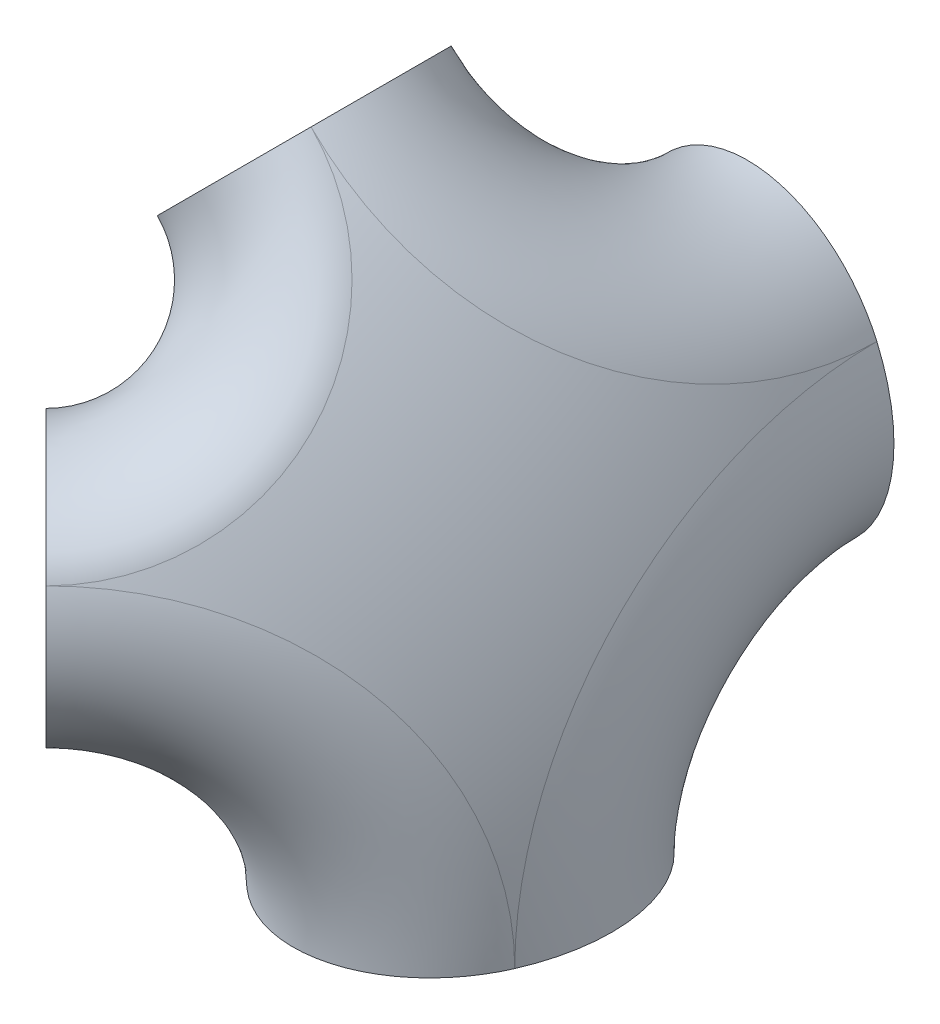
ISO-10303-21;
HEADER;
FILE_DESCRIPTION(('STEP AP214'),'2;1');
FILE_NAME('part.step','',(''),(''),'','','');
FILE_SCHEMA(('AUTOMOTIVE_DESIGN { 1 0 10303 214 1 1 1 1 }'));
ENDSEC;
DATA;
#1=APPLICATION_CONTEXT('core data for automotive mechanical design processes');
#2=APPLICATION_PROTOCOL_DEFINITION('international standard','automotive_design',2000,#1);
#3=PRODUCT_CONTEXT('',#1,'mechanical');
#4=PRODUCT('Part','Part','',(#3));
#5=PRODUCT_RELATED_PRODUCT_CATEGORY('part','',(#4));
#6=PRODUCT_DEFINITION_FORMATION('','',#4);
#7=PRODUCT_DEFINITION_CONTEXT('part definition',#1,'design');
#8=PRODUCT_DEFINITION('design','',#6,#7);
#9=PRODUCT_DEFINITION_SHAPE('','',#8);
#10=(LENGTH_UNIT() NAMED_UNIT(*) SI_UNIT(.MILLI.,.METRE.));
#11=(NAMED_UNIT(*) PLANE_ANGLE_UNIT() SI_UNIT($,.RADIAN.));
#12=(NAMED_UNIT(*) SI_UNIT($,.STERADIAN.) SOLID_ANGLE_UNIT());
#13=UNCERTAINTY_MEASURE_WITH_UNIT(LENGTH_MEASURE(1.E-05),#10,'distance_accuracy_value','');
#14=(GEOMETRIC_REPRESENTATION_CONTEXT(3) GLOBAL_UNCERTAINTY_ASSIGNED_CONTEXT((#13)) GLOBAL_UNIT_ASSIGNED_CONTEXT((#10,
#11,#12)) REPRESENTATION_CONTEXT('',''));
#15=CARTESIAN_POINT('',(0.,0.,0.));
#16=DIRECTION('',(0.,0.,1.));
#17=DIRECTION('',(1.,0.,0.));
#18=AXIS2_PLACEMENT_3D('',#15,#16,#17);
#19=CARTESIAN_POINT('',(0.,0.,0.));
#20=DIRECTION('',(0.,0.,1.));
#21=DIRECTION('',(1.,0.,0.));
#22=AXIS2_PLACEMENT_3D('',#19,#20,#21);
#23=PLANE('',#22);
#24=CARTESIAN_POINT('',(0.,0.,0.));
#25=DIRECTION('',(0.,0.,1.));
#26=DIRECTION('',(1.,0.,0.));
#27=AXIS2_PLACEMENT_3D('',#24,#25,#26);
#28=CIRCLE('',#27,3628.59960239999);
#29=CARTESIAN_POINT('',(3326.41437553861,1449.72496589782,0.));
#30=VERTEX_POINT('',#29);
#31=CARTESIAN_POINT('',(3326.4143964321,1449.72491795744,0.));
#32=VERTEX_POINT('',#31);
#33=EDGE_CURVE('E249',#30,#32,#28,.F.);
#34=ORIENTED_EDGE('',*,*,#33,.T.);
#35=CARTESIAN_POINT('',(2861.84298682111,1247.25442919149,0.));
#36=DIRECTION('',(0.,0.,-1.));
#37=DIRECTION('',(-0.399527387094056,0.916721259141401,0.));
#38=AXIS2_PLACEMENT_3D('',#35,#36,#37);
#39=ELLIPSE('',#38,654.070680233224,506.774992920008);
#40=CARTESIAN_POINT('',(2397.271573649,1044.78394859654,0.));
#41=VERTEX_POINT('',#40);
#42=EDGE_CURVE('E130',#32,#41,#39,.T.);
#43=ORIENTED_EDGE('',*,*,#42,.T.);
#44=CARTESIAN_POINT('',(2861.8429753245,1247.25445557059,0.));
#45=DIRECTION('',(0.,0.,-1.));
#46=DIRECTION('',(-0.399527310221823,0.916721292644016,0.));
#47=AXIS2_PLACEMENT_3D('',#44,#45,#46);
#48=ELLIPSE('',#47,583.48095860365,506.774992920001);
#49=EDGE_CURVE('E247',#30,#41,#48,.F.);
#50=ORIENTED_EDGE('',*,*,#49,.F.);
#51=EDGE_LOOP('',(#34,#43,#50));
#52=FACE_BOUND('',#51,.T.);
#53=ADVANCED_FACE('F59',(#52),#23,.F.);
#54=CARTESIAN_POINT('',(0.,0.,0.));
#55=DIRECTION('',(0.,1.,0.));
#56=DIRECTION('',(0.,0.,1.));
#57=AXIS2_PLACEMENT_3D('',#54,#55,#56);
#58=PLANE('',#57);
#59=CARTESIAN_POINT('',(2861.84298682111,-2.29116921664757E-13,1247.25442919149));
#60=DIRECTION('',(0.,1.,0.));
#61=DIRECTION('',(-0.399527387094056,0.,0.916721259141401));
#62=AXIS2_PLACEMENT_3D('',#59,#60,#61);
#63=ELLIPSE('',#62,654.070680233224,506.774992920008);
#64=CARTESIAN_POINT('',(2397.27157602307,0.,1044.78394314921));
#65=VERTEX_POINT('',#64);
#66=CARTESIAN_POINT('',(3326.4143964321,-2.6631014706311E-13,1449.72491795744));
#67=VERTEX_POINT('',#66);
#68=EDGE_CURVE('E237',#65,#67,#63,.F.);
#69=ORIENTED_EDGE('',*,*,#68,.T.);
#70=CARTESIAN_POINT('',(0.,0.,0.));
#71=DIRECTION('',(0.,1.,0.));
#72=DIRECTION('',(0.,0.,1.));
#73=AXIS2_PLACEMENT_3D('',#70,#71,#72);
#74=CIRCLE('',#73,3628.59960239999);
#75=CARTESIAN_POINT('',(3326.41437553861,3.66861085058443E-13,1449.72496589782));
#76=VERTEX_POINT('',#75);
#77=EDGE_CURVE('E129',#67,#76,#74,.F.);
#78=ORIENTED_EDGE('',*,*,#77,.T.);
#79=CARTESIAN_POINT('',(2861.8429753245,2.76946122828156E-13,1247.25445557059));
#80=DIRECTION('',(0.,1.,0.));
#81=DIRECTION('',(-0.399527310221823,0.,0.916721292644016));
#82=AXIS2_PLACEMENT_3D('',#79,#80,#81);
#83=ELLIPSE('',#82,583.48095860365,506.774992920001);
#84=EDGE_CURVE('E139',#65,#76,#83,.T.);
#85=ORIENTED_EDGE('',*,*,#84,.F.);
#86=EDGE_LOOP('',(#69,#78,#85));
#87=FACE_BOUND('',#86,.T.);
#88=ADVANCED_FACE('F172',(#87),#58,.F.);
#89=CARTESIAN_POINT('',(0.,0.,0.));
#90=DIRECTION('',(-0.707106781186547,0.,0.707106781186548));
#91=DIRECTION('',(0.707106781186548,0.,0.707106781186547));
#92=AXIS2_PLACEMENT_3D('',#89,#90,#91);
#93=PLANE('',#92);
#94=CARTESIAN_POINT('',(2054.5487169645,1141.68648568427,2054.54871696449));
#95=DIRECTION('',(-0.707106781186547,0.,0.707106781186548));
#96=DIRECTION('',(0.658124325987268,0.365711283784913,0.658124325987268));
#97=AXIS2_PLACEMENT_3D('',#94,#95,#96);
#98=ELLIPSE('',#97,506.774992920008,373.126714904901);
#99=CARTESIAN_POINT('',(1721.02776299877,956.353164393502,1721.02776299877));
#100=VERTEX_POINT('',#99);
#101=CARTESIAN_POINT('',(2388.06966994045,1327.01981053727,2388.06966994045));
#102=VERTEX_POINT('',#101);
#103=EDGE_CURVE('E136',#100,#102,#98,.F.);
#104=ORIENTED_EDGE('',*,*,#103,.F.);
#105=CARTESIAN_POINT('',(1721.02776189109,956.35316838019,1721.02776189109));
#106=CARTESIAN_POINT('',(1723.40242132185,947.806411229241,1723.40242132185));
#107=CARTESIAN_POINT('',(1725.90100458826,939.328491729458,1725.90100458826));
#108=CARTESIAN_POINT('',(1731.14260314192,922.522801198051,1731.14260314192));
#109=CARTESIAN_POINT('',(1733.88567503249,914.195065475923,1733.88567503249));
#110=CARTESIAN_POINT('',(1739.61209046449,897.705156078559,1739.61209046449));
#111=CARTESIAN_POINT('',(1742.59546429369,889.543003436305,1742.59546429369));
#112=CARTESIAN_POINT('',(1748.79820470788,873.399620298544,1748.79820470788));
#113=CARTESIAN_POINT('',(1752.01758035451,865.418396765491,1752.01758035451));
#114=CARTESIAN_POINT('',(1758.70311533481,849.616324910061,1758.70311533481));
#115=CARTESIAN_POINT('',(1762.17032450319,841.796364698737,1762.17032450319));
#116=CARTESIAN_POINT('',(1769.33396954872,826.369897250062,1769.33396954872));
#117=CARTESIAN_POINT('',(1773.0303923717,818.763377892606,1773.0303923717));
#118=CARTESIAN_POINT('',(1780.64787842575,803.779247005654,1780.64787842575));
#119=CARTESIAN_POINT('',(1784.56893178507,796.401625438801,1784.56893178507));
#120=CARTESIAN_POINT('',(1792.63125135689,781.8904613254,1792.63125135689));
#121=CARTESIAN_POINT('',(1796.77252224257,774.756923963783,1796.77252224257));
#122=CARTESIAN_POINT('',(1803.85955021032,763.075372399963,1803.85955021032));
#123=CARTESIAN_POINT('',(1806.74592022078,758.45501656065,1806.74592022078));
#124=CARTESIAN_POINT('',(1812.61307175791,749.33548241629,1812.61307175791));
#125=CARTESIAN_POINT('',(1815.59385499905,744.836306314506,1815.59385499905));
#126=CARTESIAN_POINT('',(1821.64811418511,735.964255697905,1821.64811418511));
#127=CARTESIAN_POINT('',(1824.72159247015,731.591384377135,1824.72159247015));
#128=CARTESIAN_POINT('',(1830.95938556457,722.977202352518,1830.95938556457));
#129=CARTESIAN_POINT('',(1834.12369993615,718.735891014782,1834.12369993615));
#130=CARTESIAN_POINT('',(1840.54157455168,710.389677874619,1840.54157455168));
#131=CARTESIAN_POINT('',(1843.79514276081,706.284788319481,1843.79514276081));
#132=CARTESIAN_POINT('',(1850.38908403108,698.217349012277,1850.38908403108));
#133=CARTESIAN_POINT('',(1853.72945271785,694.25479211112,1853.72945271785));
#134=CARTESIAN_POINT('',(1860.49047524791,686.48244433496,1860.49047524791));
#135=CARTESIAN_POINT('',(1863.91101526505,682.672455476745,1863.91101526505));
#136=CARTESIAN_POINT('',(1870.83423971231,675.205313952019,1870.83423971231));
#137=CARTESIAN_POINT('',(1874.33691964316,671.548152944665,1874.33691964316));
#138=CARTESIAN_POINT('',(1881.42228078939,664.391911506863,1881.42228078939));
#139=CARTESIAN_POINT('',(1885.00496418205,660.892835386532,1885.00496418205));
#140=CARTESIAN_POINT('',(1892.24744033134,654.058701050197,1892.24744033133));
#141=CARTESIAN_POINT('',(1895.90722875749,650.723633657829,1895.90722875749));
#142=CARTESIAN_POINT('',(1903.30120303079,644.223123186571,1903.30120303079));
#143=CARTESIAN_POINT('',(1907.03538576942,641.057673040651,1907.03538576941));
#144=CARTESIAN_POINT('',(1914.57509526717,634.902165285629,1914.57509526716));
#145=CARTESIAN_POINT('',(1918.38061928236,631.912100949018,1918.38061928235));
#146=CARTESIAN_POINT('',(1927.49827678615,625.026886027714,1927.49827678615));
#147=CARTESIAN_POINT('',(1932.84091548495,621.212132295888,1932.84091548495));
#148=CARTESIAN_POINT('',(1943.64620767444,613.939759254637,1943.64620767444));
#149=CARTESIAN_POINT('',(1949.10885896099,610.482133392848,1949.10885896099));
#150=CARTESIAN_POINT('',(1960.14435542735,603.938882129941,1960.14435542735));
#151=CARTESIAN_POINT('',(1965.71719677127,600.853243805758,1965.71719677127));
#152=CARTESIAN_POINT('',(1976.96288526548,595.068336489898,1976.96288526548));
#153=CARTESIAN_POINT('',(1982.63574082436,592.369100160164,1982.63574082436));
#154=CARTESIAN_POINT('',(1994.0647336899,587.373579550089,1994.0647336899));
#155=CARTESIAN_POINT('',(1999.82080263097,585.076982806444,1999.82080263097));
#156=CARTESIAN_POINT('',(2011.40801522387,580.897773304346,2011.40801522387));
#157=CARTESIAN_POINT('',(2017.23916262743,579.01518131972,2017.23916262743));
#158=CARTESIAN_POINT('',(2028.96161673126,575.67722998969,2028.96161673126));
#159=CARTESIAN_POINT('',(2034.85291602833,574.221818709515,2034.85291602833));
#160=CARTESIAN_POINT('',(2046.68068979548,571.74993425961,2046.68068979548));
#161=CARTESIAN_POINT('',(2052.61715749928,570.73339661405,2052.61715749928));
#162=CARTESIAN_POINT('',(2063.66636458135,569.263040801357,2063.66636458135));
#163=CARTESIAN_POINT('',(2068.77516186301,568.749435432711,2068.77516186301));
#164=CARTESIAN_POINT('',(2079.00383306236,568.057449562286,2079.00383306236));
#165=CARTESIAN_POINT('',(2084.12370613584,567.879044353733,2084.12370613584));
#166=CARTESIAN_POINT('',(2094.36343241177,567.862110327951,2094.36343241177));
#167=CARTESIAN_POINT('',(2099.48328559437,568.023559675083,2099.48328559436));
#168=CARTESIAN_POINT('',(2109.71198093705,568.689902512805,2109.71198093705));
#169=CARTESIAN_POINT('',(2114.8208228189,569.194804582198,2114.8208228189));
#170=CARTESIAN_POINT('',(2125.01139435597,570.54991181433,2125.01139435597));
#171=CARTESIAN_POINT('',(2130.0931427021,571.39983544346,2130.0931427021));
#172=CARTESIAN_POINT('',(2140.22196142037,573.446128205087,2140.22196142037));
#173=CARTESIAN_POINT('',(2145.26902989695,574.642516123075,2145.26902989695));
#174=CARTESIAN_POINT('',(2155.31572856778,577.381354588986,2155.31572856778));
#175=CARTESIAN_POINT('',(2160.3153612946,578.923786552068,2160.3153612946));
#176=CARTESIAN_POINT('',(2170.25471467571,582.352868809687,2170.25471467571));
#177=CARTESIAN_POINT('',(2175.1944422188,584.23947911726,2175.1944422188));
#178=CARTESIAN_POINT('',(2184.43759507709,588.116895676386,2184.43759507709));
#179=CARTESIAN_POINT('',(2188.74880326812,590.070700145188,2188.74880326812));
#180=CARTESIAN_POINT('',(2197.30661703364,594.242072873587,2197.30661703364));
#181=CARTESIAN_POINT('',(2201.55322754862,596.45962084628,2201.55322754862));
#182=CARTESIAN_POINT('',(2209.97380424327,601.154426508643,2209.97380424327));
#183=CARTESIAN_POINT('',(2214.14777388632,603.631671776671,2214.14777388632));
#184=CARTESIAN_POINT('',(2222.41532674772,608.84101067532,2222.41532674772));
#185=CARTESIAN_POINT('',(2226.50891153198,611.573099335585,2226.50891153198));
#186=CARTESIAN_POINT('',(2234.60737015651,617.285865777678,2234.60737015651));
#187=CARTESIAN_POINT('',(2238.61226171054,620.2664933443,2238.61226171054));
#188=CARTESIAN_POINT('',(2246.52707230052,626.470424835176,2246.52707230051));
#189=CARTESIAN_POINT('',(2250.43698874027,629.693735383415,2250.43698874026));
#190=CARTESIAN_POINT('',(2258.15491125037,636.375776565551,2258.15491125037));
#191=CARTESIAN_POINT('',(2261.96291629273,639.834509572957,2261.96291629273));
#192=CARTESIAN_POINT('',(2269.4705447286,646.979539164324,2269.4705447286));
#193=CARTESIAN_POINT('',(2273.17017219523,650.665827179954,2273.17017219523));
#194=CARTESIAN_POINT('',(2279.17129121713,656.919638718551,2279.17129121713));
#195=CARTESIAN_POINT('',(2281.50604340627,659.423628641954,2281.50604340627));
#196=CARTESIAN_POINT('',(2286.12623019811,664.521230847588,2286.12623019811));
#197=CARTESIAN_POINT('',(2288.41166388524,667.114844791308,2288.41166388524));
#198=CARTESIAN_POINT('',(2292.93157273772,672.388998145707,2292.93157273772));
#199=CARTESIAN_POINT('',(2295.16605085836,675.069532493273,2295.16605085836));
#200=CARTESIAN_POINT('',(2299.58295988105,680.515270410637,2299.58295988105));
#201=CARTESIAN_POINT('',(2301.76538877102,683.280477244227,2301.76538877102));
#202=CARTESIAN_POINT('',(2306.0767227414,688.892693769496,2306.0767227414));
#203=CARTESIAN_POINT('',(2308.20563148183,691.739697838702,2308.20563148183));
#204=CARTESIAN_POINT('',(2312.40901605477,697.513185433283,2312.40901605477));
#205=CARTESIAN_POINT('',(2314.48348978319,700.439672022062,2314.48348978319));
#206=CARTESIAN_POINT('',(2318.57698995353,706.369552468717,2318.57698995353));
#207=CARTESIAN_POINT('',(2320.59601288976,709.372951166031,2320.59601288976));
#208=CARTESIAN_POINT('',(2324.57758041351,715.453911943368,2324.57758041351));
#209=CARTESIAN_POINT('',(2326.54012285539,718.531476832746,2326.54012285539));
#210=CARTESIAN_POINT('',(2330.40771700987,724.757881425235,2330.40771700987));
#211=CARTESIAN_POINT('',(2332.31277014794,727.906719357698,2332.31277014794));
#212=CARTESIAN_POINT('',(2336.06470288174,734.273143944739,2336.06470288174));
#213=CARTESIAN_POINT('',(2337.91158039828,737.490733049589,2337.91158039828));
#214=CARTESIAN_POINT('',(2341.54635012621,743.991794909242,2341.54635012621));
#215=CARTESIAN_POINT('',(2343.33424307592,747.275266838548,2343.33424307592));
#216=CARTESIAN_POINT('',(2346.85049406558,753.905541664292,2346.85049406558));
#217=CARTESIAN_POINT('',(2348.57884977873,757.252347027975,2348.57884977873));
#218=CARTESIAN_POINT('',(2352.07417620203,764.202900154041,2352.07417620203));
#219=CARTESIAN_POINT('',(2353.83754614771,767.810270584986,2353.83754614771));
#220=CARTESIAN_POINT('',(2357.29639997842,775.089708121197,2357.29639997842));
#221=CARTESIAN_POINT('',(2358.99188111846,778.76177783385,2358.99188111846));
#222=CARTESIAN_POINT('',(2362.31438918636,786.167310707583,2362.31438918636));
#223=CARTESIAN_POINT('',(2363.94141683387,789.900773222676,2363.94141683387));
#224=CARTESIAN_POINT('',(2367.12664594554,797.426016291441,2367.12664594554));
#225=CARTESIAN_POINT('',(2368.68484485963,801.217798998847,2368.68484485963));
#226=CARTESIAN_POINT('',(2373.25550534973,812.675602277531,2373.25550534973));
#227=CARTESIAN_POINT('',(2376.16440470645,820.424912705081,2376.16440470645));
#228=CARTESIAN_POINT('',(2381.70407167554,836.121260384117,2381.70407167554));
#229=CARTESIAN_POINT('',(2384.3347798295,844.068339458566,2384.3347798295));
#230=CARTESIAN_POINT('',(2389.3168500514,860.13569078736,2389.3168500514));
#231=CARTESIAN_POINT('',(2391.66821326749,868.25596232969,2391.66821326749));
#232=CARTESIAN_POINT('',(2396.09181710842,884.647340796966,2396.09181710842));
#233=CARTESIAN_POINT('',(2398.16404435363,892.918454930582,2398.16404435363));
#234=CARTESIAN_POINT('',(2402.25125953595,910.542857940085,2402.25125953595));
#235=CARTESIAN_POINT('',(2404.23262227207,919.911766032395,2404.23262227207));
#236=CARTESIAN_POINT('',(2407.85206739279,938.781651624651,2407.85206739279));
#237=CARTESIAN_POINT('',(2409.49012631943,948.282638102253,2409.49012631943));
#238=CARTESIAN_POINT('',(2412.42583493135,967.389164422406,2412.42583493135));
#239=CARTESIAN_POINT('',(2413.72348161051,976.994705187473,2413.72348161051));
#240=CARTESIAN_POINT('',(2415.98273242183,996.29129590565,2415.98273242183));
#241=CARTESIAN_POINT('',(2416.94409878422,1005.98240141429,2416.94409878422));
#242=CARTESIAN_POINT('',(2418.53356831692,1025.418793024,2418.53356831692));
#243=CARTESIAN_POINT('',(2419.16167874519,1035.16407794043,2419.16167874518));
#244=CARTESIAN_POINT('',(2420.08908845732,1054.6859597567,2420.08908845732));
#245=CARTESIAN_POINT('',(2420.38837760925,1064.46255761207,2420.38837760925));
#246=CARTESIAN_POINT('',(2420.68079367621,1085.31192045494,2420.68079367621));
#247=CARTESIAN_POINT('',(2420.62846311562,1096.3859999324,2420.62846311562));
#248=CARTESIAN_POINT('',(2420.11558469301,1118.51615384405,2420.11558469301));
#249=CARTESIAN_POINT('',(2419.65499207119,1129.57222617087,2419.65499207119));
#250=CARTESIAN_POINT('',(2418.3325485185,1151.63764310676,2418.3325485185));
#251=CARTESIAN_POINT('',(2417.47064445573,1162.6469813336,2417.47064445573));
#252=CARTESIAN_POINT('',(2415.35366584544,1184.57945544273,2415.35366584544));
#253=CARTESIAN_POINT('',(2414.09895164805,1195.50266096237,2414.09895164805));
#254=CARTESIAN_POINT('',(2411.20347786628,1217.24438000762,2411.20347786628));
#255=CARTESIAN_POINT('',(2409.56277421673,1228.06290846601,2409.56277421673));
#256=CARTESIAN_POINT('',(2405.90290736819,1249.56696410624,2405.90290736819));
#257=CARTESIAN_POINT('',(2403.88390103201,1260.2525444635,2403.88390103201));
#258=CARTESIAN_POINT('',(2400.69147731837,1275.61219837979,2400.69147731837));
#259=CARTESIAN_POINT('',(2399.66644980145,1280.34887004627,2399.66644980145));
#260=CARTESIAN_POINT('',(2397.54256162707,1289.78826109439,2397.54256162707));
#261=CARTESIAN_POINT('',(2396.44371305108,1294.4909858929,2396.44371305107));
#262=CARTESIAN_POINT('',(2394.17455733836,1303.8531388232,2394.17455733836));
#263=CARTESIAN_POINT('',(2393.004370903,1308.51262551845,2393.004370903));
#264=CARTESIAN_POINT('',(2390.5913335957,1317.79466657331,2390.5913335957));
#265=CARTESIAN_POINT('',(2389.3484710524,1322.41721486459,2389.3484710524));
#266=CARTESIAN_POINT('',(2388.06967071821,1327.01980773798,2388.06967071821));
#267=B_SPLINE_CURVE_WITH_KNOTS('',3,(#105,#106,#107,#108,#109,#110,#111,#112,#113,#114,#115,
#116,#117,#118,#119,#120,#121,#122,#123,#124,#125,#126,#127,#128,#129,#130,#131,#132,#133,#134,
#135,#136,#137,#138,#139,#140,#141,#142,#143,#144,#145,#146,#147,#148,#149,#150,#151,#152,#153,
#154,#155,#156,#157,#158,#159,#160,#161,#162,#163,#164,#165,#166,#167,#168,#169,#170,#171,#172,
#173,#174,#175,#176,#177,#178,#179,#180,#181,#182,#183,#184,#185,#186,#187,#188,#189,#190,#191,
#192,#193,#194,#195,#196,#197,#198,#199,#200,#201,#202,#203,#204,#205,#206,#207,#208,#209,#210,
#211,#212,#213,#214,#215,#216,#217,#218,#219,#220,#221,#222,#223,#224,#225,#226,#227,#228,#229,
#230,#231,#232,#233,#234,#235,#236,#237,#238,#239,#240,#241,#242,#243,#244,#245,#246,#247,#248,
#249,#250,#251,#252,#253,#254,#255,#256,#257,#258,#259,#260,#261,#262,#263,#264,#265,#266),
.UNSPECIFIED.,.F.,.F.,(4,2,2,2,2,2,2,2,2,2,2,2,2,2,2,2,2,2,2,2,2,2,2,2,2,2,2,2,2,2,2,2,2,2,2,2,
2,2,2,2,2,2,2,2,2,2,2,2,2,2,2,2,2,2,2,2,2,2,2,2,2,2,2,2,2,2,2,2,2,2,2,2,2,2,2,2,2,2,2,2,4),(0.,
27.5467147795453,55.0998237463003,82.6564109703535,110.214056823988,137.896281666664,
165.576931397389,193.256365588259,220.936387391729,239.429666550111,257.923281722498,
276.417364160178,294.911357474736,313.407006629977,331.901725481925,350.371610415704,
368.840486003558,387.309864833687,405.778209115136,424.245783321721,442.712648678935,
468.095277368612,493.477440270477,518.858721126793,544.242146156995,569.605784661403,
594.970695565901,620.332521436382,645.690620079783,667.412660881046,689.133100541677,
710.852144707701,732.571731394465,754.27363066047,775.976706836197,797.678617692959,
819.378008805193,838.579195718028,857.778906647507,876.977699649739,896.17611828512,
915.370667395822,934.565740608105,953.761007372082,972.955551799927,985.385916350684,
997.816511464693,1010.24638379291,1022.67673584858,1035.10623551743,1047.53621492397,
1059.96697837663,1072.39821343891,1084.82914000817,1097.26051035369,1109.69172503428,
1122.12342499192,1135.27817569684,1148.43345775785,1161.58860148495,1174.74423219646,
1201.05253256271,1227.36644454373,1253.68024836595,1279.99531302023,1309.31869287899,
1338.64407575317,1367.96971758492,1397.31605263824,1426.66174853481,1456.00834863227,
1489.21568565729,1522.42666381884,1555.64204022138,1588.82703485914,1622.00722352395,
1655.17368438288,1670.03332195744,1684.89053351862,1699.72326963988,1714.55839438989),.UNSPECIFIED.);
#268=EDGE_CURVE('E235',#100,#102,#267,.T.);
#269=ORIENTED_EDGE('',*,*,#268,.T.);
#270=EDGE_LOOP('',(#104,#269));
#271=FACE_BOUND('',#270,.T.);
#272=ADVANCED_FACE('F167',(#271),#93,.T.);
#273=CARTESIAN_POINT('',(0.,0.,0.));
#274=DIRECTION('',(-0.707106781186547,0.707106781186548,0.));
#275=DIRECTION('',(-0.707106781186548,-0.707106781186547,0.));
#276=AXIS2_PLACEMENT_3D('',#273,#274,#275);
#277=PLANE('',#276);
#278=CARTESIAN_POINT('',(2054.5487169645,2054.54871696449,1141.68648568427));
#279=DIRECTION('',(0.707106781186547,-0.707106781186548,0.));
#280=DIRECTION('',(0.658124325987268,0.658124325987268,0.365711283784913));
#281=AXIS2_PLACEMENT_3D('',#278,#279,#280);
#282=ELLIPSE('',#281,506.774992920008,373.126714904901);
#283=CARTESIAN_POINT('',(2388.06966994045,2388.06966994045,1327.01981053727));
#284=VERTEX_POINT('',#283);
#285=CARTESIAN_POINT('',(1721.02776410645,1721.02776410645,956.353160406796));
#286=VERTEX_POINT('',#285);
#287=EDGE_CURVE('E128',#284,#286,#282,.T.);
#288=ORIENTED_EDGE('',*,*,#287,.F.);
#289=CARTESIAN_POINT('',(2388.06967071821,2388.06967071821,1327.01980773798));
#290=CARTESIAN_POINT('',(2390.44433436571,2390.4443343657,1318.47305329388));
#291=CARTESIAN_POINT('',(2392.69508633744,2392.69508633744,1309.8574174713));
#292=CARTESIAN_POINT('',(2396.94526475803,2396.94526475803,1292.50080815268));
#293=CARTESIAN_POINT('',(2398.94463274747,2398.94463274747,1283.75980602725));
#294=CARTESIAN_POINT('',(2402.68767112835,2402.68767112835,1266.1677600397));
#295=CARTESIAN_POINT('',(2404.43130920906,2404.43130920906,1257.31670242539));
#296=CARTESIAN_POINT('',(2407.65862826128,2407.65862826128,1239.51991633127));
#297=CARTESIAN_POINT('',(2409.14229924355,2409.14229924355,1230.57418422759));
#298=CARTESIAN_POINT('',(2411.85167024626,2411.85167024626,1212.56260949203));
#299=CARTESIAN_POINT('',(2413.07617374385,2413.07617374385,1203.49640669911));
#300=CARTESIAN_POINT('',(2415.25452055963,2415.25452055963,1185.29967332179));
#301=CARTESIAN_POINT('',(2416.20837927436,2416.20837927436,1176.16914642697));
#302=CARTESIAN_POINT('',(2417.84135657976,2417.84135657976,1157.85950107543));
#303=CARTESIAN_POINT('',(2418.52048723325,2418.52048723325,1148.68038477011));
#304=CARTESIAN_POINT('',(2419.59994873392,2419.59994873392,1130.28893621207));
#305=CARTESIAN_POINT('',(2420.00027366209,2420.00027366209,1121.07660325834));
#306=CARTESIAN_POINT('',(2420.43206445823,2420.43206445823,1105.69682188119));
#307=CARTESIAN_POINT('',(2420.5418548549,2420.5418548549,1099.53355639968));
#308=CARTESIAN_POINT('',(2420.63394735677,2420.63394735677,1087.20489607999));
#309=CARTESIAN_POINT('',(2420.61624714554,2420.61624714554,1081.03950120515));
#310=CARTESIAN_POINT('',(2420.45215092952,2420.45215092952,1068.71199028031));
#311=CARTESIAN_POINT('',(2420.30575167307,2420.30575167307,1062.54987431708));
#312=CARTESIAN_POINT('',(2419.88308551373,2419.88308551373,1050.23456051752));
#313=CARTESIAN_POINT('',(2419.60681923667,2419.60681923666,1044.08136263837));
#314=CARTESIAN_POINT('',(2418.92325009575,2418.92325009575,1031.78896826545));
#315=CARTESIAN_POINT('',(2418.51593550188,2418.51593550188,1025.64977307461));
#316=CARTESIAN_POINT('',(2417.56920316492,2417.56920316492,1013.39207811545));
#317=CARTESIAN_POINT('',(2417.02979206744,2417.02979206744,1007.2735773217));
#318=CARTESIAN_POINT('',(2415.81862362941,2415.81862362941,995.071185213019));
#319=CARTESIAN_POINT('',(2415.14704497042,2415.14704497042,988.98725845757));
#320=CARTESIAN_POINT('',(2413.67014570847,2413.67014570847,976.852275847849));
#321=CARTESIAN_POINT('',(2412.86483241628,2412.86483241628,970.801218215409));
#322=CARTESIAN_POINT('',(2411.1195092779,2411.1195092779,958.737878681999));
#323=CARTESIAN_POINT('',(2410.17949576209,2410.17949576209,952.725597842086));
#324=CARTESIAN_POINT('',(2408.16403250507,2408.16403250507,940.746945199059));
#325=CARTESIAN_POINT('',(2407.08859035319,2407.08859035319,934.780570843247));
#326=CARTESIAN_POINT('',(2404.8015576104,2404.8015576104,922.900448802437));
#327=CARTESIAN_POINT('',(2403.58997269836,2403.58997269836,916.986698933434));
#328=CARTESIAN_POINT('',(2401.03011445082,2401.03011445082,905.218990763075));
#329=CARTESIAN_POINT('',(2399.68184636369,2399.68184636369,899.365030175424));
#330=CARTESIAN_POINT('',(2396.31738162383,2396.31738162383,885.543660076825));
#331=CARTESIAN_POINT('',(2394.24013920231,2394.24013920231,877.605773700336));
#332=CARTESIAN_POINT('',(2389.82582955889,2389.82582955889,861.876063344723));
#333=CARTESIAN_POINT('',(2387.48876710563,2387.48876710563,854.084236687929));
#334=CARTESIAN_POINT('',(2382.55485529063,2382.55485529063,838.666990212636));
#335=CARTESIAN_POINT('',(2379.95801495945,2379.95801495945,831.041564620805));
#336=CARTESIAN_POINT('',(2374.50509356944,2374.50509356944,815.977454041147));
#337=CARTESIAN_POINT('',(2371.64899062887,2371.64899062887,808.538784883313));
#338=CARTESIAN_POINT('',(2365.68181219691,2365.68181219691,793.876435003034));
#339=CARTESIAN_POINT('',(2362.57093719354,2362.57093719354,786.652591215823));
#340=CARTESIAN_POINT('',(2356.09491596819,2356.09491596819,772.435874277534));
#341=CARTESIAN_POINT('',(2352.72975699818,2352.72975699818,765.443012731583));
#342=CARTESIAN_POINT('',(2345.7497160734,2345.7497160734,751.712324627314));
#343=CARTESIAN_POINT('',(2342.13486454122,2342.13486454121,744.974467153544));
#344=CARTESIAN_POINT('',(2334.66077989389,2334.66077989389,731.776787296427));
#345=CARTESIAN_POINT('',(2330.80158277165,2330.80158277165,725.316924197978));
#346=CARTESIAN_POINT('',(2323.41570362154,2323.41570362154,713.60242712183));
#347=CARTESIAN_POINT('',(2319.92068880423,2319.92068880423,708.307793581792));
#348=CARTESIAN_POINT('',(2312.76117925298,2312.76117925298,697.953418366205));
#349=CARTESIAN_POINT('',(2309.09669703047,2309.09669703047,692.893659405444));
#350=CARTESIAN_POINT('',(2301.60414188682,2301.60414188682,683.023123619981));
#351=CARTESIAN_POINT('',(2297.77607949118,2297.77607949118,678.212330819561));
#352=CARTESIAN_POINT('',(2289.96269773743,2289.96269773743,668.852922322311));
#353=CARTESIAN_POINT('',(2285.97737445359,2285.97737445359,664.304313177403));
#354=CARTESIAN_POINT('',(2277.86037038588,2277.86037038587,655.486134862095));
#355=CARTESIAN_POINT('',(2273.72881143165,2273.72881143165,651.216341471114));
#356=CARTESIAN_POINT('',(2265.32432809521,2265.32432809521,642.963915291013));
#357=CARTESIAN_POINT('',(2261.05139605879,2261.05139605879,638.981298087376));
#358=CARTESIAN_POINT('',(2252.37369791964,2252.37369791964,631.315228601197));
#359=CARTESIAN_POINT('',(2247.96893890788,2247.96893890788,627.63176026687));
#360=CARTESIAN_POINT('',(2239.03761178388,2239.03761178388,620.574646488828));
#361=CARTESIAN_POINT('',(2234.5110578739,2234.5110578739,617.200965122163));
#362=CARTESIAN_POINT('',(2225.87389145459,2225.87389145459,611.142516599361));
#363=CARTESIAN_POINT('',(2221.77538933842,2221.77538933842,608.423152424155));
#364=CARTESIAN_POINT('',(2213.49874002629,2213.49874002629,603.23982893715));
#365=CARTESIAN_POINT('',(2209.32059897682,2209.32059897682,600.775850008611));
#366=CARTESIAN_POINT('',(2200.8925139384,2200.8925139384,596.108069397052));
#367=CARTESIAN_POINT('',(2196.64257339186,2196.64257339186,593.904255280743));
#368=CARTESIAN_POINT('',(2188.07890061614,2188.07890061614,589.760696871033));
#369=CARTESIAN_POINT('',(2183.7651696325,2183.76516963249,587.820947429238));
#370=CARTESIAN_POINT('',(2175.08302677063,2175.08302677063,584.208947703955));
#371=CARTESIAN_POINT('',(2170.71462608881,2170.71462608881,582.536643583706));
#372=CARTESIAN_POINT('',(2161.93057670882,2161.93057670882,579.461231568701));
#373=CARTESIAN_POINT('',(2157.51492672381,2157.51492672381,578.058131025512));
#374=CARTESIAN_POINT('',(2148.64495371489,2148.64495371489,575.522490172669));
#375=CARTESIAN_POINT('',(2144.19063030147,2144.19063030147,574.389952591331));
#376=CARTESIAN_POINT('',(2135.25183257877,2135.25183257877,572.395912805961));
#377=CARTESIAN_POINT('',(2130.7673594104,2130.7673594104,571.534400404222));
#378=CARTESIAN_POINT('',(2123.36109840394,2123.36109840394,570.337901767206));
#379=CARTESIAN_POINT('',(2120.44552977919,2120.44552977919,569.924355374856));
#380=CARTESIAN_POINT('',(2114.60737693393,2114.60737693393,569.210391624027));
#381=CARTESIAN_POINT('',(2111.68479258432,2111.68479258431,568.909976364051));
#382=CARTESIAN_POINT('',(2105.83510848628,2105.83510848627,568.421879160275));
#383=CARTESIAN_POINT('',(2102.90800901029,2102.90800901028,568.234190662535));
#384=CARTESIAN_POINT('',(2097.05117822309,2097.05117822309,567.970942385428));
#385=CARTESIAN_POINT('',(2094.12144681467,2094.12144681467,567.895386933917));
#386=CARTESIAN_POINT('',(2088.26181355397,2088.26181355397,567.855726671498));
#387=CARTESIAN_POINT('',(2085.33191172715,2085.33191172715,567.89161421844));
#388=CARTESIAN_POINT('',(2079.47372196264,2079.47372196264,568.074013256285));
#389=CARTESIAN_POINT('',(2076.54543409161,2076.54543409161,568.220529016853));
#390=CARTESIAN_POINT('',(2070.69245344709,2070.69245344709,568.623276904452));
#391=CARTESIAN_POINT('',(2067.76776091202,2067.76776091202,568.879515951496));
#392=CARTESIAN_POINT('',(2061.9240470199,2061.9240470199,569.500693124951));
#393=CARTESIAN_POINT('',(2059.00502588223,2059.00502588223,569.865635374918));
#394=CARTESIAN_POINT('',(2053.17478682594,2053.17478682594,570.703077700159));
#395=CARTESIAN_POINT('',(2050.26356871549,2050.26356871548,571.175575106057));
#396=CARTESIAN_POINT('',(2044.45065185834,2044.45065185834,572.226934721763));
#397=CARTESIAN_POINT('',(2041.5489534552,2041.5489534552,572.805800728125));
#398=CARTESIAN_POINT('',(2035.75704978841,2035.75704978841,574.068580360885));
#399=CARTESIAN_POINT('',(2032.86684438131,2032.86684438131,574.752492671794));
#400=CARTESIAN_POINT('',(2027.09955807491,2027.09955807491,576.224024169668));
#401=CARTESIAN_POINT('',(2024.22247769237,2024.22247769237,577.011647403994));
#402=CARTESIAN_POINT('',(2018.31634733498,2018.31634733498,578.737930932678));
#403=CARTESIAN_POINT('',(2015.28819112531,2015.28819112531,579.682711451969));
#404=CARTESIAN_POINT('',(2009.25046311403,2009.25046311403,581.68501970578));
#405=CARTESIAN_POINT('',(2006.24089206802,2006.24089206802,582.742551992923));
#406=CARTESIAN_POINT('',(2000.24234062487,2000.24234062487,584.968491113414));
#407=CARTESIAN_POINT('',(1997.25336001153,1997.25336001153,586.13689678075));
#408=CARTESIAN_POINT('',(1991.2977423074,1991.2977423074,588.582688000763));
#409=CARTESIAN_POINT('',(1988.33110604782,1988.33110604782,589.860077586117));
#410=CARTESIAN_POINT('',(1979.46764047354,1979.46764047354,593.852708578105));
#411=CARTESIAN_POINT('',(1973.60657858338,1973.60657858338,596.728663552869));
#412=CARTESIAN_POINT('',(1961.993010057,1961.993010057,602.893177374639));
#413=CARTESIAN_POINT('',(1956.24052684252,1956.24052684252,606.18182410008));
#414=CARTESIAN_POINT('',(1944.85681487267,1944.85681487267,613.15491935884));
#415=CARTESIAN_POINT('',(1939.22558561902,1939.22558561902,616.839366265225));
#416=CARTESIAN_POINT('',(1928.09498016437,1928.09498016437,624.587469398561));
#417=CARTESIAN_POINT('',(1922.59561029408,1922.59561029408,628.651143786958));
#418=CARTESIAN_POINT('',(1911.11787560511,1911.11787560511,637.626303252544));
#419=CARTESIAN_POINT('',(1905.15662302685,1905.15662302685,642.58160170299));
#420=CARTESIAN_POINT('',(1893.42200048417,1893.42200048417,652.919428525262));
#421=CARTESIAN_POINT('',(1887.64864338141,1887.64864338141,658.301986057106));
#422=CARTESIAN_POINT('',(1876.30095398751,1876.30095398751,669.471411136125));
#423=CARTESIAN_POINT('',(1870.7266234543,1870.7266234543,675.258282253139));
#424=CARTESIAN_POINT('',(1859.78295578918,1859.78295578918,687.218180477779));
#425=CARTESIAN_POINT('',(1854.41376608353,1854.41376608353,693.391477189481));
#426=CARTESIAN_POINT('',(1843.89342472073,1843.89342472073,706.098602298236));
#427=CARTESIAN_POINT('',(1838.74226831731,1838.74226831731,712.632422840059));
#428=CARTESIAN_POINT('',(1828.66574058246,1828.66574058246,726.039557975013));
#429=CARTESIAN_POINT('',(1823.74037621283,1823.74037621283,732.912883022448));
#430=CARTESIAN_POINT('',(1813.48998242591,1813.4899824259,747.903741994224));
#431=CARTESIAN_POINT('',(1808.19761833584,1808.19761833584,756.06600225623));
#432=CARTESIAN_POINT('',(1797.92058066706,1797.92058066706,772.7703386038));
#433=CARTESIAN_POINT('',(1792.93594088979,1792.93594088979,781.312456237487));
#434=CARTESIAN_POINT('',(1783.28308046204,1783.28308046204,798.748768008962));
#435=CARTESIAN_POINT('',(1778.61490180342,1778.61490180342,807.643008623605));
#436=CARTESIAN_POINT('',(1769.60804098276,1769.60804098275,825.746864354006));
#437=CARTESIAN_POINT('',(1765.2690613393,1765.2690613393,834.956183558506));
#438=CARTESIAN_POINT('',(1756.92427965011,1756.92427965011,853.66979303181));
#439=CARTESIAN_POINT('',(1752.91842944336,1752.91842944336,863.174040388664));
#440=CARTESIAN_POINT('',(1745.24797707982,1745.24797707982,882.44946617494));
#441=CARTESIAN_POINT('',(1741.58323442246,1741.58323442246,892.220532538726));
#442=CARTESIAN_POINT('',(1736.52808707572,1736.52808707571,906.54509702068));
#443=CARTESIAN_POINT('',(1734.99885259594,1734.99885259594,911.00158894723));
#444=CARTESIAN_POINT('',(1732.01081073909,1732.01081073909,919.96078409761));
#445=CARTESIAN_POINT('',(1730.55199190471,1730.55199190471,924.463479658107));
#446=CARTESIAN_POINT('',(1727.7075400127,1727.7075400127,933.505951125139));
#447=CARTESIAN_POINT('',(1726.32179034946,1726.32179034946,938.045653726672));
#448=CARTESIAN_POINT('',(1723.62129653712,1723.62129653712,947.167962154279));
#449=CARTESIAN_POINT('',(1722.30656385852,1722.30656385852,951.75057477166));
#450=CARTESIAN_POINT('',(1721.02776189109,1721.02776189109,956.353168380189));
#451=B_SPLINE_CURVE_WITH_KNOTS('',3,(#289,#290,#291,#292,#293,#294,#295,#296,#297,#298,#299,
#300,#301,#302,#303,#304,#305,#306,#307,#308,#309,#310,#311,#312,#313,#314,#315,#316,#317,#318,
#319,#320,#321,#322,#323,#324,#325,#326,#327,#328,#329,#330,#331,#332,#333,#334,#335,#336,#337,
#338,#339,#340,#341,#342,#343,#344,#345,#346,#347,#348,#349,#350,#351,#352,#353,#354,#355,#356,
#357,#358,#359,#360,#361,#362,#363,#364,#365,#366,#367,#368,#369,#370,#371,#372,#373,#374,#375,
#376,#377,#378,#379,#380,#381,#382,#383,#384,#385,#386,#387,#388,#389,#390,#391,#392,#393,#394,
#395,#396,#397,#398,#399,#400,#401,#402,#403,#404,#405,#406,#407,#408,#409,#410,#411,#412,#413,
#414,#415,#416,#417,#418,#419,#420,#421,#422,#423,#424,#425,#426,#427,#428,#429,#430,#431,#432,
#433,#434,#435,#436,#437,#438,#439,#440,#441,#442,#443,#444,#445,#446,#447,#448,#449,#450),
.UNSPECIFIED.,.F.,.F.,(4,2,2,2,2,2,2,2,2,2,2,2,2,2,2,2,2,2,2,2,2,2,2,2,2,2,2,2,2,2,2,2,2,2,2,2,
2,2,2,2,2,2,2,2,2,2,2,2,2,2,2,2,2,2,2,2,2,2,2,2,2,2,2,2,2,2,2,2,2,2,2,2,2,2,2,2,2,2,2,2,4),(0.,
27.5467137645136,55.0998217229336,82.6564079418998,110.21405279125,137.89627668715,
165.576925469701,193.256358711306,220.936379565641,239.429658116107,257.923272680576,
276.417354510879,294.911347218034,313.406995766279,331.901714011179,350.371598320857,
368.840473284549,387.309851490337,405.778195147375,424.245768728623,442.712633460395,
468.095260327905,493.477421407147,518.858700440496,544.242123647135,569.605760329674,
594.970669412436,620.332493461726,645.690590283774,667.41262935981,689.133067294999,
710.85210973565,732.571694696305,754.273592244148,775.976666701435,797.678575840771,
819.377965236643,838.579151370988,857.778861522318,876.977653746775,896.176071604148,
915.370619941002,934.565692379093,953.760958369254,972.95550202395,985.385866692045,
997.816461923424,1010.24633436942,1022.67668654284,1035.10618632957,1047.53616585396,
1059.96692942601,1072.39816460765,1084.82909129616,1097.26046176091,1109.69167656095,
1122.12337663803,1135.27812793571,1148.43341058951,1161.58855490971,1174.74418621434,
1201.05248776696,1227.36640093639,1253.68020594681,1279.99527178954,1309.31865347441,
1338.64403817518,1367.96968183368,1397.31601871575,1426.66171644094,1456.00831836719,
1489.21565737661,1522.42663752276,1555.64201591022,1588.82701253133,1622.00720317928,
1655.1736660207,1670.03330819184,1684.89052434839,1699.72326505489,1714.55839439135),.UNSPECIFIED.);
#452=EDGE_CURVE('E118',#284,#286,#451,.T.);
#453=ORIENTED_EDGE('',*,*,#452,.T.);
#454=EDGE_LOOP('',(#288,#453));
#455=FACE_BOUND('',#454,.T.);
#456=ADVANCED_FACE('F127',(#455),#277,.T.);
#457=CARTESIAN_POINT('',(0.,0.,0.));
#458=DIRECTION('',(1.,0.,0.));
#459=DIRECTION('',(0.,1.,0.));
#460=AXIS2_PLACEMENT_3D('',#457,#458,#459);
#461=SPHERICAL_SURFACE('',#460,2615.04961656);
#462=CARTESIAN_POINT('',(1721.02776189109,1721.02776189109,0.));
#463=DIRECTION('',(-0.707106781186548,-0.707106781186547,0.));
#464=DIRECTION('',(0.707106781186547,-0.707106781186548,0.));
#465=AXIS2_PLACEMENT_3D('',#462,#463,#464);
#466=CIRCLE('',#465,956.353168380189);
#467=CARTESIAN_POINT('',(1721.11007899157,1720.94544479061,956.353161294853));
#468=VERTEX_POINT('',#467);
#469=EDGE_CURVE('E76',#41,#468,#466,.T.);
#470=ORIENTED_EDGE('',*,*,#469,.F.);
#471=CARTESIAN_POINT('',(2397.27157721011,0.,0.));
#472=DIRECTION('',(-1.,0.,0.));
#473=DIRECTION('',(0.,0.,1.));
#474=AXIS2_PLACEMENT_3D('',#471,#472,#473);
#475=CIRCLE('',#474,1044.78394042554);
#476=EDGE_CURVE('E123',#65,#41,#475,.T.);
#477=ORIENTED_EDGE('',*,*,#476,.F.);
#478=CARTESIAN_POINT('',(1721.02776189109,3.82144929454117E-13,1721.02776189109));
#479=DIRECTION('',(0.707106781186548,0.,0.707106781186547));
#480=DIRECTION('',(0.707106781186547,0.,-0.707106781186548));
#481=AXIS2_PLACEMENT_3D('',#478,#479,#480);
#482=CIRCLE('',#481,956.353168380189);
#483=CARTESIAN_POINT('',(1721.11008221019,956.353161294277,1720.94544157199));
#484=VERTEX_POINT('',#483);
#485=EDGE_CURVE('E84',#65,#484,#482,.T.);
#486=ORIENTED_EDGE('',*,*,#485,.T.);
#487=CARTESIAN_POINT('',(1466.13622835901,1466.13622835901,1466.13622835901));
#488=DIRECTION('',(-0.577350269189626,-0.577350269189626,-0.577350269189626));
#489=DIRECTION('',(-0.707106781186547,0.,0.707106781186548));
#490=AXIS2_PLACEMENT_3D('',#487,#488,#489);
#491=CIRCLE('',#490,624.354207762116);
#492=EDGE_CURVE('E68',#468,#484,#491,.T.);
#493=ORIENTED_EDGE('',*,*,#492,.F.);
#494=EDGE_LOOP('',(#470,#477,#486,#493));
#495=FACE_BOUND('',#494,.T.);
#496=ADVANCED_FACE('F176',(#495),#461,.F.);
#497=CARTESIAN_POINT('',(2861.8429753245,1247.25445557059,0.));
#498=DIRECTION('',(0.,0.,-1.));
#499=DIRECTION('',(-0.399527310221823,0.916721292644016,0.));
#500=AXIS2_PLACEMENT_3D('',#497,#498,#499);
#501=ELLIPSE('',#500,583.48095860365,506.774992920001);
#502=CARTESIAN_POINT('',(1849.11931700886,1849.11931700886,0.));
#503=DIRECTION('',(-0.707106781186548,-0.707106781186547,0.));
#504=AXIS1_PLACEMENT('',#502,#503);
#505=SURFACE_OF_REVOLUTION('',#501,#504);
#506=CARTESIAN_POINT('',(2388.06967071821,2388.06967071821,0.));
#507=DIRECTION('',(-0.707106781186548,-0.707106781186547,0.));
#508=DIRECTION('',(0.707106781186547,-0.707106781186548,0.));
#509=AXIS2_PLACEMENT_3D('',#506,#507,#508);
#510=CIRCLE('',#509,1327.01980773798);
#511=EDGE_CURVE('E232',#30,#284,#510,.T.);
#512=ORIENTED_EDGE('',*,*,#511,.F.);
#513=ORIENTED_EDGE('',*,*,#49,.T.);
#514=ORIENTED_EDGE('',*,*,#469,.T.);
#515=CARTESIAN_POINT('',(1466.13622835901,1466.13622835901,1466.13622835901));
#516=DIRECTION('',(-0.577350269189626,-0.577350269189626,-0.577350269189626));
#517=DIRECTION('',(0.408248290463863,0.408248290463863,-0.816496580927726));
#518=AXIS2_PLACEMENT_3D('',#515,#516,#517);
#519=CIRCLE('',#518,624.354207762116);
#520=EDGE_CURVE('E113',#286,#468,#519,.T.);
#521=ORIENTED_EDGE('',*,*,#520,.F.);
#522=ORIENTED_EDGE('',*,*,#452,.F.);
#523=EDGE_LOOP('',(#512,#513,#514,#521,#522));
#524=FACE_BOUND('',#523,.T.);
#525=ADVANCED_FACE('F117',(#524),#505,.T.);
#526=CARTESIAN_POINT('',(0.,0.,0.));
#527=DIRECTION('',(1.,0.,0.));
#528=DIRECTION('',(0.,-1.,0.));
#529=AXIS2_PLACEMENT_3D('',#526,#527,#528);
#530=SPHERICAL_SURFACE('',#529,3628.59960239999);
#531=CARTESIAN_POINT('',(2034.3863847165,2034.3863847165,2034.3863847165));
#532=DIRECTION('',(-0.577350269189626,-0.577350269189626,-0.577350269189626));
#533=DIRECTION('',(-0.707106781186547,0.,0.707106781186548));
#534=AXIS2_PLACEMENT_3D('',#531,#532,#533);
#535=CIRCLE('',#534,866.343573634604);
#536=EDGE_CURVE('E13',#284,#102,#535,.T.);
#537=ORIENTED_EDGE('',*,*,#536,.T.);
#538=CARTESIAN_POINT('',(2388.06967071821,5.30257986568075E-13,2388.06967071821));
#539=DIRECTION('',(0.707106781186548,0.,0.707106781186547));
#540=DIRECTION('',(0.707106781186547,0.,-0.707106781186548));
#541=AXIS2_PLACEMENT_3D('',#538,#539,#540);
#542=CIRCLE('',#541,1327.01980773798);
#543=EDGE_CURVE('E143',#76,#102,#542,.T.);
#544=ORIENTED_EDGE('',*,*,#543,.F.);
#545=ORIENTED_EDGE('',*,*,#77,.F.);
#546=CARTESIAN_POINT('',(3326.4143964321,0.,0.));
#547=DIRECTION('',(-1.,0.,0.));
#548=DIRECTION('',(0.,0.,1.));
#549=AXIS2_PLACEMENT_3D('',#546,#547,#548);
#550=CIRCLE('',#549,1449.72491795742);
#551=EDGE_CURVE('E135',#67,#32,#550,.T.);
#552=ORIENTED_EDGE('',*,*,#551,.T.);
#553=ORIENTED_EDGE('',*,*,#33,.F.);
#554=ORIENTED_EDGE('',*,*,#511,.T.);
#555=EDGE_LOOP('',(#537,#544,#545,#552,#553,#554));
#556=FACE_BOUND('',#555,.T.);
#557=ADVANCED_FACE('F61',(#556),#530,.T.);
#558=CARTESIAN_POINT('',(2861.8429753245,2.76946122828156E-13,1247.25445557059));
#559=DIRECTION('',(0.,1.,0.));
#560=DIRECTION('',(-0.399527310221823,0.,0.916721292644016));
#561=AXIS2_PLACEMENT_3D('',#558,#559,#560);
#562=ELLIPSE('',#561,583.48095860365,506.774992920001);
#563=CARTESIAN_POINT('',(1849.11931700886,4.10586968204475E-13,1849.11931700886));
#564=DIRECTION('',(-0.707106781186548,0.,-0.707106781186547));
#565=AXIS1_PLACEMENT('',#563,#564);
#566=SURFACE_OF_REVOLUTION('',#562,#565);
#567=ORIENTED_EDGE('',*,*,#268,.F.);
#568=CARTESIAN_POINT('',(1466.13622953991,1466.13622953991,1466.13622953991));
#569=DIRECTION('',(-0.577350269189626,-0.577350269189626,-0.577350269189626));
#570=DIRECTION('',(0.408380126956448,-0.816496566734785,0.408116439778337));
#571=AXIS2_PLACEMENT_3D('',#568,#569,#570);
#572=CIRCLE('',#571,624.354199443017);
#573=EDGE_CURVE('E222',#484,#100,#572,.T.);
#574=ORIENTED_EDGE('',*,*,#573,.F.);
#575=ORIENTED_EDGE('',*,*,#485,.F.);
#576=ORIENTED_EDGE('',*,*,#84,.T.);
#577=ORIENTED_EDGE('',*,*,#543,.T.);
#578=EDGE_LOOP('',(#567,#574,#575,#576,#577));
#579=FACE_BOUND('',#578,.T.);
#580=ADVANCED_FACE('F163',(#579),#566,.T.);
#581=CARTESIAN_POINT('',(2054.5487169645,2054.54871696449,1141.68648568427));
#582=DIRECTION('',(0.707106781186547,-0.707106781186548,0.));
#583=DIRECTION('',(0.658124325987268,0.658124325987268,0.365711283784913));
#584=AXIS2_PLACEMENT_3D('',#581,#582,#583);
#585=ELLIPSE('',#584,506.774992920008,373.126714904901);
#586=CARTESIAN_POINT('',(1509.79960006514,1509.79960006514,1509.79960006514));
#587=DIRECTION('',(-0.577350269189626,-0.577350269189626,-0.577350269189626));
#588=AXIS1_PLACEMENT('',#586,#587);
#589=SURFACE_OF_REVOLUTION('',#585,#588);
#590=ORIENTED_EDGE('',*,*,#573,.T.);
#591=ORIENTED_EDGE('',*,*,#103,.T.);
#592=ORIENTED_EDGE('',*,*,#536,.F.);
#593=ORIENTED_EDGE('',*,*,#287,.T.);
#594=ORIENTED_EDGE('',*,*,#520,.T.);
#595=ORIENTED_EDGE('',*,*,#492,.T.);
#596=EDGE_LOOP('',(#590,#591,#592,#593,#594,#595));
#597=FACE_BOUND('',#596,.T.);
#598=ADVANCED_FACE('F133',(#597),#589,.F.);
#599=CARTESIAN_POINT('',(2861.84298682111,1247.25442919149,0.));
#600=DIRECTION('',(0.,0.,-1.));
#601=DIRECTION('',(-0.399527387094056,0.916721259141401,0.));
#602=AXIS2_PLACEMENT_3D('',#599,#600,#601);
#603=ELLIPSE('',#602,654.070680233224,506.774992920008);
#604=CARTESIAN_POINT('',(2615.04961656,0.,0.));
#605=DIRECTION('',(-1.,0.,0.));
#606=AXIS1_PLACEMENT('',#604,#605);
#607=SURFACE_OF_REVOLUTION('',#603,#606);
#608=ORIENTED_EDGE('',*,*,#42,.F.);
#609=ORIENTED_EDGE('',*,*,#551,.F.);
#610=ORIENTED_EDGE('',*,*,#68,.F.);
#611=ORIENTED_EDGE('',*,*,#476,.T.);
#612=EDGE_LOOP('',(#608,#609,#610,#611));
#613=FACE_BOUND('',#612,.T.);
#614=ADVANCED_FACE('F177',(#613),#607,.F.);
#615=CLOSED_SHELL('',(#53,#88,#272,#456,#496,#525,#557,#580,#598,#614));
#616=MANIFOLD_SOLID_BREP('B2',#615);
#617=ADVANCED_BREP_SHAPE_REPRESENTATION('',(#18,#616),#14);
#618=SHAPE_DEFINITION_REPRESENTATION(#9,#617);
ENDSEC;
END-ISO-10303-21;
